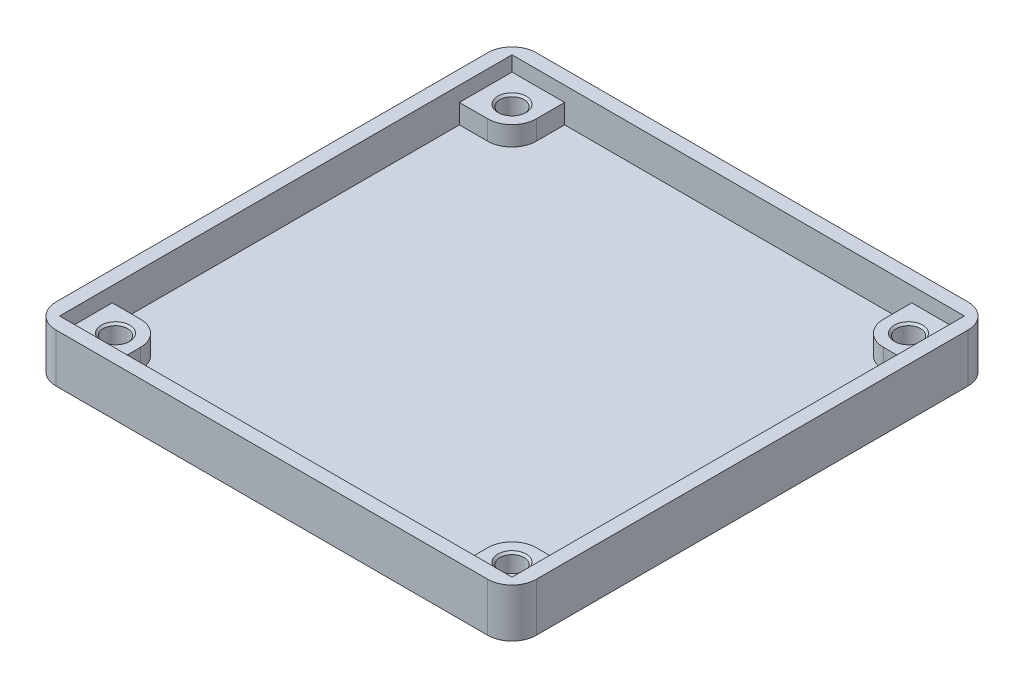
ISO-10303-21;
HEADER;
FILE_DESCRIPTION(('STEP AP214'),'2;1');
FILE_NAME('part.step','',(''),(''),'','','');
FILE_SCHEMA(('AUTOMOTIVE_DESIGN { 1 0 10303 214 1 1 1 1 }'));
ENDSEC;
DATA;
#1=APPLICATION_CONTEXT('core data for automotive mechanical design processes');
#2=APPLICATION_PROTOCOL_DEFINITION('international standard','automotive_design',2000,#1);
#3=PRODUCT_CONTEXT('',#1,'mechanical');
#4=PRODUCT('Part','Part','',(#3));
#5=PRODUCT_RELATED_PRODUCT_CATEGORY('part','',(#4));
#6=PRODUCT_DEFINITION_FORMATION('','',#4);
#7=PRODUCT_DEFINITION_CONTEXT('part definition',#1,'design');
#8=PRODUCT_DEFINITION('design','',#6,#7);
#9=PRODUCT_DEFINITION_SHAPE('','',#8);
#10=(LENGTH_UNIT() NAMED_UNIT(*) SI_UNIT(.MILLI.,.METRE.));
#11=(NAMED_UNIT(*) PLANE_ANGLE_UNIT() SI_UNIT($,.RADIAN.));
#12=(NAMED_UNIT(*) SI_UNIT($,.STERADIAN.) SOLID_ANGLE_UNIT());
#13=UNCERTAINTY_MEASURE_WITH_UNIT(LENGTH_MEASURE(1.E-05),#10,'distance_accuracy_value','');
#14=(GEOMETRIC_REPRESENTATION_CONTEXT(3) GLOBAL_UNCERTAINTY_ASSIGNED_CONTEXT((#13)) GLOBAL_UNIT_ASSIGNED_CONTEXT((#10,
#11,#12)) REPRESENTATION_CONTEXT('',''));
#15=CARTESIAN_POINT('',(0.,0.,0.));
#16=DIRECTION('',(0.,0.,1.));
#17=DIRECTION('',(1.,0.,0.));
#18=AXIS2_PLACEMENT_3D('',#15,#16,#17);
#19=CARTESIAN_POINT('',(0.,4.15,0.));
#20=DIRECTION('',(0.,1.,0.));
#21=DIRECTION('',(0.,0.,1.));
#22=AXIS2_PLACEMENT_3D('',#19,#20,#21);
#23=PLANE('',#22);
#24=CARTESIAN_POINT('',(-24.5,4.15,-24.5));
#25=DIRECTION('',(0.,1.,0.));
#26=DIRECTION('',(0.,0.,1.));
#27=AXIS2_PLACEMENT_3D('',#24,#25,#26);
#28=CIRCLE('',#27,1.75000000000001);
#29=CARTESIAN_POINT('',(-24.5,4.15,-22.75));
#30=VERTEX_POINT('',#29);
#31=EDGE_CURVE('E47',#30,#30,#28,.F.);
#32=ORIENTED_EDGE('',*,*,#31,.T.);
#33=EDGE_LOOP('',(#32));
#34=FACE_BOUND('',#33,.T.);
#35=DIRECTION('',(-1.,0.,0.));
#36=VECTOR('',#35,1.);
#37=CARTESIAN_POINT('',(-27.95,4.15,-21.45));
#38=LINE('',#37,#36);
#39=CARTESIAN_POINT('',(-24.45,4.15,-21.45));
#40=VERTEX_POINT('',#39);
#41=CARTESIAN_POINT('',(-27.95,4.15,-21.45));
#42=VERTEX_POINT('',#41);
#43=EDGE_CURVE('E252',#40,#42,#38,.T.);
#44=ORIENTED_EDGE('',*,*,#43,.F.);
#45=CARTESIAN_POINT('',(-24.45,4.15,-24.45));
#46=DIRECTION('',(0.,1.,0.));
#47=DIRECTION('',(0.,0.,1.));
#48=AXIS2_PLACEMENT_3D('',#45,#46,#47);
#49=CIRCLE('',#48,3.);
#50=CARTESIAN_POINT('',(-21.45,4.15,-24.45));
#51=VERTEX_POINT('',#50);
#52=EDGE_CURVE('E434',#40,#51,#49,.T.);
#53=ORIENTED_EDGE('',*,*,#52,.T.);
#54=DIRECTION('',(0.,0.,1.));
#55=VECTOR('',#54,1.);
#56=CARTESIAN_POINT('',(-21.45,4.15,-21.45));
#57=LINE('',#56,#55);
#58=CARTESIAN_POINT('',(-21.45,4.15,-27.95));
#59=VERTEX_POINT('',#58);
#60=EDGE_CURVE('E254',#59,#51,#57,.T.);
#61=ORIENTED_EDGE('',*,*,#60,.F.);
#62=DIRECTION('',(-1.,0.,0.));
#63=VECTOR('',#62,1.);
#64=CARTESIAN_POINT('',(27.95,4.15,-27.95));
#65=LINE('',#64,#63);
#66=CARTESIAN_POINT('',(-27.95,4.15,-27.95));
#67=VERTEX_POINT('',#66);
#68=EDGE_CURVE('E323',#59,#67,#65,.T.);
#69=ORIENTED_EDGE('',*,*,#68,.T.);
#70=DIRECTION('',(0.,0.,1.));
#71=VECTOR('',#70,1.);
#72=CARTESIAN_POINT('',(-27.95,4.15,27.95));
#73=LINE('',#72,#71);
#74=EDGE_CURVE('E312',#67,#42,#73,.T.);
#75=ORIENTED_EDGE('',*,*,#74,.T.);
#76=EDGE_LOOP('',(#44,#53,#61,#69,#75));
#77=FACE_BOUND('',#76,.T.);
#78=ADVANCED_FACE('F38',(#34,#77),#23,.T.);
#79=CARTESIAN_POINT('',(24.5,4.15,-24.5));
#80=DIRECTION('',(0.,1.,0.));
#81=DIRECTION('',(0.,0.,1.));
#82=AXIS2_PLACEMENT_3D('',#79,#80,#81);
#83=CIRCLE('',#82,1.75000000000001);
#84=CARTESIAN_POINT('',(24.5,4.15,-22.75));
#85=VERTEX_POINT('',#84);
#86=EDGE_CURVE('E463',#85,#85,#83,.F.);
#87=ORIENTED_EDGE('',*,*,#86,.T.);
#88=EDGE_LOOP('',(#87));
#89=FACE_BOUND('',#88,.T.);
#90=DIRECTION('',(0.,0.,-1.));
#91=VECTOR('',#90,1.);
#92=CARTESIAN_POINT('',(21.45,4.15,-27.95));
#93=LINE('',#92,#91);
#94=CARTESIAN_POINT('',(21.45,4.15,-24.45));
#95=VERTEX_POINT('',#94);
#96=CARTESIAN_POINT('',(21.45,4.15,-27.95));
#97=VERTEX_POINT('',#96);
#98=EDGE_CURVE('E291',#95,#97,#93,.T.);
#99=ORIENTED_EDGE('',*,*,#98,.F.);
#100=CARTESIAN_POINT('',(24.45,4.15,-24.45));
#101=DIRECTION('',(0.,1.,0.));
#102=DIRECTION('',(0.,0.,1.));
#103=AXIS2_PLACEMENT_3D('',#100,#101,#102);
#104=CIRCLE('',#103,3.);
#105=CARTESIAN_POINT('',(24.45,4.15,-21.45));
#106=VERTEX_POINT('',#105);
#107=EDGE_CURVE('E62',#95,#106,#104,.T.);
#108=ORIENTED_EDGE('',*,*,#107,.T.);
#109=DIRECTION('',(-1.,0.,0.));
#110=VECTOR('',#109,1.);
#111=CARTESIAN_POINT('',(21.45,4.15,-21.45));
#112=LINE('',#111,#110);
#113=CARTESIAN_POINT('',(27.95,4.15,-21.45));
#114=VERTEX_POINT('',#113);
#115=EDGE_CURVE('E289',#114,#106,#112,.T.);
#116=ORIENTED_EDGE('',*,*,#115,.F.);
#117=DIRECTION('',(0.,0.,-1.));
#118=VECTOR('',#117,1.);
#119=CARTESIAN_POINT('',(27.95,4.15,27.95));
#120=LINE('',#119,#118);
#121=CARTESIAN_POINT('',(27.95,4.15,-27.95));
#122=VERTEX_POINT('',#121);
#123=EDGE_CURVE('E319',#114,#122,#120,.T.);
#124=ORIENTED_EDGE('',*,*,#123,.T.);
#125=EDGE_CURVE('E324',#122,#97,#65,.T.);
#126=ORIENTED_EDGE('',*,*,#125,.T.);
#127=EDGE_LOOP('',(#99,#108,#116,#124,#126));
#128=FACE_BOUND('',#127,.T.);
#129=ADVANCED_FACE('F483',(#89,#128),#23,.T.);
#130=CARTESIAN_POINT('',(24.5,4.15,24.5));
#131=DIRECTION('',(0.,1.,0.));
#132=DIRECTION('',(0.,0.,1.));
#133=AXIS2_PLACEMENT_3D('',#130,#131,#132);
#134=CIRCLE('',#133,1.75000000000001);
#135=CARTESIAN_POINT('',(24.5,4.15,26.25));
#136=VERTEX_POINT('',#135);
#137=EDGE_CURVE('E451',#136,#136,#134,.F.);
#138=ORIENTED_EDGE('',*,*,#137,.T.);
#139=EDGE_LOOP('',(#138));
#140=FACE_BOUND('',#139,.T.);
#141=DIRECTION('',(1.,0.,0.));
#142=VECTOR('',#141,1.);
#143=CARTESIAN_POINT('',(27.95,4.15,21.45));
#144=LINE('',#143,#142);
#145=CARTESIAN_POINT('',(24.45,4.15,21.45));
#146=VERTEX_POINT('',#145);
#147=CARTESIAN_POINT('',(27.95,4.15,21.45));
#148=VERTEX_POINT('',#147);
#149=EDGE_CURVE('E287',#146,#148,#144,.T.);
#150=ORIENTED_EDGE('',*,*,#149,.F.);
#151=CARTESIAN_POINT('',(24.45,4.15,24.45));
#152=DIRECTION('',(0.,1.,0.));
#153=DIRECTION('',(0.,0.,1.));
#154=AXIS2_PLACEMENT_3D('',#151,#152,#153);
#155=CIRCLE('',#154,3.);
#156=CARTESIAN_POINT('',(21.45,4.15,24.45));
#157=VERTEX_POINT('',#156);
#158=EDGE_CURVE('E421',#146,#157,#155,.T.);
#159=ORIENTED_EDGE('',*,*,#158,.T.);
#160=DIRECTION('',(0.,0.,-1.));
#161=VECTOR('',#160,1.);
#162=CARTESIAN_POINT('',(21.45,4.15,21.45));
#163=LINE('',#162,#161);
#164=CARTESIAN_POINT('',(21.45,4.15,27.95));
#165=VERTEX_POINT('',#164);
#166=EDGE_CURVE('E284',#165,#157,#163,.T.);
#167=ORIENTED_EDGE('',*,*,#166,.F.);
#168=DIRECTION('',(1.,0.,0.));
#169=VECTOR('',#168,1.);
#170=CARTESIAN_POINT('',(27.95,4.15,27.95));
#171=LINE('',#170,#169);
#172=CARTESIAN_POINT('',(27.95,4.15,27.95));
#173=VERTEX_POINT('',#172);
#174=EDGE_CURVE('E315',#165,#173,#171,.T.);
#175=ORIENTED_EDGE('',*,*,#174,.T.);
#176=EDGE_CURVE('E320',#173,#148,#120,.T.);
#177=ORIENTED_EDGE('',*,*,#176,.T.);
#178=EDGE_LOOP('',(#150,#159,#167,#175,#177));
#179=FACE_BOUND('',#178,.T.);
#180=ADVANCED_FACE('F489',(#140,#179),#23,.T.);
#181=CARTESIAN_POINT('',(-24.5,0.,-24.5));
#182=DIRECTION('',(0.,1.,0.));
#183=DIRECTION('',(0.,0.,1.));
#184=AXIS2_PLACEMENT_3D('',#181,#182,#183);
#185=CYLINDRICAL_SURFACE('',#184,1.5);
#186=CARTESIAN_POINT('',(-24.5,3.89999999999999,-24.5));
#187=DIRECTION('',(0.,1.,0.));
#188=DIRECTION('',(0.,0.,1.));
#189=AXIS2_PLACEMENT_3D('',#186,#187,#188);
#190=CIRCLE('',#189,1.5);
#191=CARTESIAN_POINT('',(-24.5,3.89999999999999,-23.));
#192=VERTEX_POINT('',#191);
#193=EDGE_CURVE('E11',#192,#192,#190,.T.);
#194=ORIENTED_EDGE('',*,*,#193,.T.);
#195=EDGE_LOOP('',(#194));
#196=FACE_BOUND('',#195,.T.);
#197=CARTESIAN_POINT('',(-24.5,0.,-24.5));
#198=DIRECTION('',(0.,1.,0.));
#199=DIRECTION('',(0.,0.,1.));
#200=AXIS2_PLACEMENT_3D('',#197,#198,#199);
#201=CIRCLE('',#200,1.5);
#202=CARTESIAN_POINT('',(-24.5,0.,-23.));
#203=VERTEX_POINT('',#202);
#204=EDGE_CURVE('E353',#203,#203,#201,.T.);
#205=ORIENTED_EDGE('',*,*,#204,.F.);
#206=EDGE_LOOP('',(#205));
#207=FACE_BOUND('',#206,.T.);
#208=ADVANCED_FACE('F507',(#196,#207),#185,.F.);
#209=CARTESIAN_POINT('',(24.5,0.,24.5));
#210=DIRECTION('',(0.,1.,0.));
#211=DIRECTION('',(0.,0.,1.));
#212=AXIS2_PLACEMENT_3D('',#209,#210,#211);
#213=CYLINDRICAL_SURFACE('',#212,1.5);
#214=CARTESIAN_POINT('',(24.5,3.89999999999999,24.5));
#215=DIRECTION('',(0.,1.,0.));
#216=DIRECTION('',(0.,0.,1.));
#217=AXIS2_PLACEMENT_3D('',#214,#215,#216);
#218=CIRCLE('',#217,1.5);
#219=CARTESIAN_POINT('',(24.5,3.89999999999999,26.));
#220=VERTEX_POINT('',#219);
#221=EDGE_CURVE('E454',#220,#220,#218,.T.);
#222=ORIENTED_EDGE('',*,*,#221,.T.);
#223=EDGE_LOOP('',(#222));
#224=FACE_BOUND('',#223,.T.);
#225=CARTESIAN_POINT('',(24.5,0.,24.5));
#226=DIRECTION('',(0.,1.,0.));
#227=DIRECTION('',(0.,0.,1.));
#228=AXIS2_PLACEMENT_3D('',#225,#226,#227);
#229=CIRCLE('',#228,1.5);
#230=CARTESIAN_POINT('',(24.5,0.,26.));
#231=VERTEX_POINT('',#230);
#232=EDGE_CURVE('E340',#231,#231,#229,.T.);
#233=ORIENTED_EDGE('',*,*,#232,.F.);
#234=EDGE_LOOP('',(#233));
#235=FACE_BOUND('',#234,.T.);
#236=ADVANCED_FACE('F512',(#224,#235),#213,.F.);
#237=CARTESIAN_POINT('',(-24.5,0.,24.5));
#238=DIRECTION('',(0.,1.,0.));
#239=DIRECTION('',(0.,0.,1.));
#240=AXIS2_PLACEMENT_3D('',#237,#238,#239);
#241=CYLINDRICAL_SURFACE('',#240,1.5);
#242=CARTESIAN_POINT('',(-24.5,3.89999999999999,24.5));
#243=DIRECTION('',(0.,1.,0.));
#244=DIRECTION('',(0.,0.,1.));
#245=AXIS2_PLACEMENT_3D('',#242,#243,#244);
#246=CIRCLE('',#245,1.5);
#247=CARTESIAN_POINT('',(-24.5,3.89999999999999,26.));
#248=VERTEX_POINT('',#247);
#249=EDGE_CURVE('E460',#248,#248,#246,.T.);
#250=ORIENTED_EDGE('',*,*,#249,.T.);
#251=EDGE_LOOP('',(#250));
#252=FACE_BOUND('',#251,.T.);
#253=CARTESIAN_POINT('',(-24.5,0.,24.5));
#254=DIRECTION('',(0.,1.,0.));
#255=DIRECTION('',(0.,0.,1.));
#256=AXIS2_PLACEMENT_3D('',#253,#254,#255);
#257=CIRCLE('',#256,1.5);
#258=CARTESIAN_POINT('',(-24.5,0.,26.));
#259=VERTEX_POINT('',#258);
#260=EDGE_CURVE('E349',#259,#259,#257,.T.);
#261=ORIENTED_EDGE('',*,*,#260,.F.);
#262=EDGE_LOOP('',(#261));
#263=FACE_BOUND('',#262,.T.);
#264=ADVANCED_FACE('F659',(#252,#263),#241,.F.);
#265=CARTESIAN_POINT('',(24.5,0.,-24.5));
#266=DIRECTION('',(0.,1.,0.));
#267=DIRECTION('',(0.,0.,1.));
#268=AXIS2_PLACEMENT_3D('',#265,#266,#267);
#269=CYLINDRICAL_SURFACE('',#268,1.5);
#270=CARTESIAN_POINT('',(24.5,3.89999999999999,-24.5));
#271=DIRECTION('',(0.,1.,0.));
#272=DIRECTION('',(0.,0.,1.));
#273=AXIS2_PLACEMENT_3D('',#270,#271,#272);
#274=CIRCLE('',#273,1.5);
#275=CARTESIAN_POINT('',(24.5,3.89999999999999,-23.));
#276=VERTEX_POINT('',#275);
#277=EDGE_CURVE('E466',#276,#276,#274,.T.);
#278=ORIENTED_EDGE('',*,*,#277,.T.);
#279=EDGE_LOOP('',(#278));
#280=FACE_BOUND('',#279,.T.);
#281=CARTESIAN_POINT('',(24.5,0.,-24.5));
#282=DIRECTION('',(0.,1.,0.));
#283=DIRECTION('',(0.,0.,1.));
#284=AXIS2_PLACEMENT_3D('',#281,#282,#283);
#285=CIRCLE('',#284,1.5);
#286=CARTESIAN_POINT('',(24.5,0.,-23.));
#287=VERTEX_POINT('',#286);
#288=EDGE_CURVE('E350',#287,#287,#285,.T.);
#289=ORIENTED_EDGE('',*,*,#288,.F.);
#290=EDGE_LOOP('',(#289));
#291=FACE_BOUND('',#290,.T.);
#292=ADVANCED_FACE('F662',(#280,#291),#269,.F.);
#293=CARTESIAN_POINT('',(-29.675,6.,29.675));
#294=DIRECTION('',(0.,0.,-1.));
#295=DIRECTION('',(-1.,0.,0.));
#296=AXIS2_PLACEMENT_3D('',#293,#294,#295);
#297=PLANE('',#296);
#298=DIRECTION('',(1.,0.,0.));
#299=VECTOR('',#298,1.);
#300=CARTESIAN_POINT('',(-29.675,6.,29.675));
#301=LINE('',#300,#299);
#302=CARTESIAN_POINT('',(-26.675,6.,29.675));
#303=VERTEX_POINT('',#302);
#304=CARTESIAN_POINT('',(26.675,6.,29.675));
#305=VERTEX_POINT('',#304);
#306=EDGE_CURVE('E359',#303,#305,#301,.T.);
#307=ORIENTED_EDGE('',*,*,#306,.F.);
#308=DIRECTION('',(0.,-1.,0.));
#309=VECTOR('',#308,1.);
#310=CARTESIAN_POINT('',(-26.675,0.,29.675));
#311=LINE('',#310,#309);
#312=CARTESIAN_POINT('',(-26.675,0.,29.675));
#313=VERTEX_POINT('',#312);
#314=EDGE_CURVE('E384',#303,#313,#311,.T.);
#315=ORIENTED_EDGE('',*,*,#314,.T.);
#316=DIRECTION('',(1.,0.,0.));
#317=VECTOR('',#316,1.);
#318=CARTESIAN_POINT('',(-29.675,0.,29.675));
#319=LINE('',#318,#317);
#320=CARTESIAN_POINT('',(26.675,0.,29.675));
#321=VERTEX_POINT('',#320);
#322=EDGE_CURVE('E358',#313,#321,#319,.T.);
#323=ORIENTED_EDGE('',*,*,#322,.T.);
#324=DIRECTION('',(0.,-1.,0.));
#325=VECTOR('',#324,1.);
#326=CARTESIAN_POINT('',(26.675,6.,29.675));
#327=LINE('',#326,#325);
#328=EDGE_CURVE('E372',#321,#305,#327,.F.);
#329=ORIENTED_EDGE('',*,*,#328,.T.);
#330=EDGE_LOOP('',(#307,#315,#323,#329));
#331=FACE_BOUND('',#330,.T.);
#332=ADVANCED_FACE('F618',(#331),#297,.F.);
#333=CARTESIAN_POINT('',(29.675,6.,29.675));
#334=DIRECTION('',(-1.,0.,0.));
#335=DIRECTION('',(0.,0.,1.));
#336=AXIS2_PLACEMENT_3D('',#333,#334,#335);
#337=PLANE('',#336);
#338=DIRECTION('',(0.,0.,-1.));
#339=VECTOR('',#338,1.);
#340=CARTESIAN_POINT('',(29.675,6.,29.675));
#341=LINE('',#340,#339);
#342=CARTESIAN_POINT('',(29.675,6.,26.675));
#343=VERTEX_POINT('',#342);
#344=CARTESIAN_POINT('',(29.675,6.,-26.675));
#345=VERTEX_POINT('',#344);
#346=EDGE_CURVE('E362',#343,#345,#341,.T.);
#347=ORIENTED_EDGE('',*,*,#346,.F.);
#348=DIRECTION('',(0.,-1.,0.));
#349=VECTOR('',#348,1.);
#350=CARTESIAN_POINT('',(29.675,6.,26.675));
#351=LINE('',#350,#349);
#352=CARTESIAN_POINT('',(29.675,0.,26.675));
#353=VERTEX_POINT('',#352);
#354=EDGE_CURVE('E410',#343,#353,#351,.T.);
#355=ORIENTED_EDGE('',*,*,#354,.T.);
#356=DIRECTION('',(0.,0.,-1.));
#357=VECTOR('',#356,1.);
#358=CARTESIAN_POINT('',(29.675,0.,29.675));
#359=LINE('',#358,#357);
#360=CARTESIAN_POINT('',(29.675,0.,-26.675));
#361=VERTEX_POINT('',#360);
#362=EDGE_CURVE('E375',#353,#361,#359,.T.);
#363=ORIENTED_EDGE('',*,*,#362,.T.);
#364=DIRECTION('',(0.,-1.,0.));
#365=VECTOR('',#364,1.);
#366=CARTESIAN_POINT('',(29.675,6.,-26.675));
#367=LINE('',#366,#365);
#368=EDGE_CURVE('E408',#361,#345,#367,.F.);
#369=ORIENTED_EDGE('',*,*,#368,.T.);
#370=EDGE_LOOP('',(#347,#355,#363,#369));
#371=FACE_BOUND('',#370,.T.);
#372=ADVANCED_FACE('F684',(#371),#337,.F.);
#373=CARTESIAN_POINT('',(-29.675,6.,-29.675));
#374=DIRECTION('',(0.,0.,-1.));
#375=DIRECTION('',(-1.,0.,0.));
#376=AXIS2_PLACEMENT_3D('',#373,#374,#375);
#377=PLANE('',#376);
#378=DIRECTION('',(1.,0.,0.));
#379=VECTOR('',#378,1.);
#380=CARTESIAN_POINT('',(-29.675,6.,-29.675));
#381=LINE('',#380,#379);
#382=CARTESIAN_POINT('',(-26.675,6.,-29.675));
#383=VERTEX_POINT('',#382);
#384=CARTESIAN_POINT('',(26.675,6.,-29.675));
#385=VERTEX_POINT('',#384);
#386=EDGE_CURVE('E366',#383,#385,#381,.T.);
#387=ORIENTED_EDGE('',*,*,#386,.T.);
#388=DIRECTION('',(0.,-1.,0.));
#389=VECTOR('',#388,1.);
#390=CARTESIAN_POINT('',(26.675,0.,-29.675));
#391=LINE('',#390,#389);
#392=CARTESIAN_POINT('',(26.675,0.,-29.675));
#393=VERTEX_POINT('',#392);
#394=EDGE_CURVE('E415',#385,#393,#391,.T.);
#395=ORIENTED_EDGE('',*,*,#394,.T.);
#396=DIRECTION('',(1.,0.,0.));
#397=VECTOR('',#396,1.);
#398=CARTESIAN_POINT('',(-29.675,0.,-29.675));
#399=LINE('',#398,#397);
#400=CARTESIAN_POINT('',(-26.675,0.,-29.675));
#401=VERTEX_POINT('',#400);
#402=EDGE_CURVE('E378',#401,#393,#399,.T.);
#403=ORIENTED_EDGE('',*,*,#402,.F.);
#404=DIRECTION('',(0.,-1.,0.));
#405=VECTOR('',#404,1.);
#406=CARTESIAN_POINT('',(-26.675,6.,-29.675));
#407=LINE('',#406,#405);
#408=EDGE_CURVE('E413',#401,#383,#407,.F.);
#409=ORIENTED_EDGE('',*,*,#408,.T.);
#410=EDGE_LOOP('',(#387,#395,#403,#409));
#411=FACE_BOUND('',#410,.T.);
#412=ADVANCED_FACE('F690',(#411),#377,.T.);
#413=CARTESIAN_POINT('',(-29.675,6.,29.675));
#414=DIRECTION('',(-1.,0.,0.));
#415=DIRECTION('',(0.,0.,1.));
#416=AXIS2_PLACEMENT_3D('',#413,#414,#415);
#417=PLANE('',#416);
#418=DIRECTION('',(0.,0.,-1.));
#419=VECTOR('',#418,1.);
#420=CARTESIAN_POINT('',(-29.675,0.,29.675));
#421=LINE('',#420,#419);
#422=CARTESIAN_POINT('',(-29.675,0.,26.675));
#423=VERTEX_POINT('',#422);
#424=CARTESIAN_POINT('',(-29.675,0.,-26.675));
#425=VERTEX_POINT('',#424);
#426=EDGE_CURVE('E363',#423,#425,#421,.T.);
#427=ORIENTED_EDGE('',*,*,#426,.F.);
#428=DIRECTION('',(0.,-1.,0.));
#429=VECTOR('',#428,1.);
#430=CARTESIAN_POINT('',(-29.675,6.,26.675));
#431=LINE('',#430,#429);
#432=CARTESIAN_POINT('',(-29.675,6.,26.675));
#433=VERTEX_POINT('',#432);
#434=EDGE_CURVE('E398',#423,#433,#431,.F.);
#435=ORIENTED_EDGE('',*,*,#434,.T.);
#436=DIRECTION('',(0.,0.,-1.));
#437=VECTOR('',#436,1.);
#438=CARTESIAN_POINT('',(-29.675,6.,29.675));
#439=LINE('',#438,#437);
#440=CARTESIAN_POINT('',(-29.675,6.,-26.675));
#441=VERTEX_POINT('',#440);
#442=EDGE_CURVE('E369',#433,#441,#439,.T.);
#443=ORIENTED_EDGE('',*,*,#442,.T.);
#444=DIRECTION('',(0.,-1.,0.));
#445=VECTOR('',#444,1.);
#446=CARTESIAN_POINT('',(-29.675,6.,-26.675));
#447=LINE('',#446,#445);
#448=EDGE_CURVE('E395',#441,#425,#447,.T.);
#449=ORIENTED_EDGE('',*,*,#448,.T.);
#450=EDGE_LOOP('',(#427,#435,#443,#449));
#451=FACE_BOUND('',#450,.T.);
#452=ADVANCED_FACE('F695',(#451),#417,.T.);
#453=CARTESIAN_POINT('',(0.,6.,0.));
#454=DIRECTION('',(0.,1.,0.));
#455=DIRECTION('',(0.,0.,1.));
#456=AXIS2_PLACEMENT_3D('',#453,#454,#455);
#457=PLANE('',#456);
#458=DIRECTION('',(0.,0.,1.));
#459=VECTOR('',#458,1.);
#460=CARTESIAN_POINT('',(-27.95,6.,27.95));
#461=LINE('',#460,#459);
#462=CARTESIAN_POINT('',(-27.95,6.,-27.95));
#463=VERTEX_POINT('',#462);
#464=CARTESIAN_POINT('',(-27.95,6.,27.95));
#465=VERTEX_POINT('',#464);
#466=EDGE_CURVE('E297',#463,#465,#461,.T.);
#467=ORIENTED_EDGE('',*,*,#466,.F.);
#468=DIRECTION('',(-1.,0.,0.));
#469=VECTOR('',#468,1.);
#470=CARTESIAN_POINT('',(27.95,6.,-27.95));
#471=LINE('',#470,#469);
#472=CARTESIAN_POINT('',(27.95,6.,-27.95));
#473=VERTEX_POINT('',#472);
#474=EDGE_CURVE('E335',#473,#463,#471,.T.);
#475=ORIENTED_EDGE('',*,*,#474,.F.);
#476=DIRECTION('',(0.,0.,-1.));
#477=VECTOR('',#476,1.);
#478=CARTESIAN_POINT('',(27.95,6.,27.95));
#479=LINE('',#478,#477);
#480=CARTESIAN_POINT('',(27.95,6.,27.95));
#481=VERTEX_POINT('',#480);
#482=EDGE_CURVE('E332',#481,#473,#479,.T.);
#483=ORIENTED_EDGE('',*,*,#482,.F.);
#484=DIRECTION('',(1.,0.,0.));
#485=VECTOR('',#484,1.);
#486=CARTESIAN_POINT('',(27.95,6.,27.95));
#487=LINE('',#486,#485);
#488=EDGE_CURVE('E329',#465,#481,#487,.T.);
#489=ORIENTED_EDGE('',*,*,#488,.F.);
#490=EDGE_LOOP('',(#467,#475,#483,#489));
#491=FACE_BOUND('',#490,.T.);
#492=ORIENTED_EDGE('',*,*,#442,.F.);
#493=CARTESIAN_POINT('',(-26.675,6.,26.675));
#494=DIRECTION('',(0.,1.,0.));
#495=DIRECTION('',(0.,0.,1.));
#496=AXIS2_PLACEMENT_3D('',#493,#494,#495);
#497=CIRCLE('',#496,3.);
#498=EDGE_CURVE('E406',#433,#303,#497,.T.);
#499=ORIENTED_EDGE('',*,*,#498,.T.);
#500=ORIENTED_EDGE('',*,*,#306,.T.);
#501=CARTESIAN_POINT('',(26.675,6.,26.675));
#502=DIRECTION('',(0.,1.,0.));
#503=DIRECTION('',(0.,0.,1.));
#504=AXIS2_PLACEMENT_3D('',#501,#502,#503);
#505=CIRCLE('',#504,3.);
#506=EDGE_CURVE('E404',#305,#343,#505,.T.);
#507=ORIENTED_EDGE('',*,*,#506,.T.);
#508=ORIENTED_EDGE('',*,*,#346,.T.);
#509=CARTESIAN_POINT('',(26.675,6.,-26.675));
#510=DIRECTION('',(0.,1.,0.));
#511=DIRECTION('',(0.,0.,1.));
#512=AXIS2_PLACEMENT_3D('',#509,#510,#511);
#513=CIRCLE('',#512,3.);
#514=EDGE_CURVE('E402',#345,#385,#513,.T.);
#515=ORIENTED_EDGE('',*,*,#514,.T.);
#516=ORIENTED_EDGE('',*,*,#386,.F.);
#517=CARTESIAN_POINT('',(-26.675,6.,-26.675));
#518=DIRECTION('',(0.,1.,0.));
#519=DIRECTION('',(0.,0.,1.));
#520=AXIS2_PLACEMENT_3D('',#517,#518,#519);
#521=CIRCLE('',#520,3.);
#522=EDGE_CURVE('E400',#383,#441,#521,.T.);
#523=ORIENTED_EDGE('',*,*,#522,.T.);
#524=EDGE_LOOP('',(#492,#499,#500,#507,#508,#515,#516,#523));
#525=FACE_BOUND('',#524,.T.);
#526=ADVANCED_FACE('F502',(#491,#525),#457,.T.);
#527=CARTESIAN_POINT('',(0.,0.,0.));
#528=DIRECTION('',(0.,1.,0.));
#529=DIRECTION('',(0.,0.,1.));
#530=AXIS2_PLACEMENT_3D('',#527,#528,#529);
#531=PLANE('',#530);
#532=ORIENTED_EDGE('',*,*,#288,.T.);
#533=EDGE_LOOP('',(#532));
#534=FACE_BOUND('',#533,.T.);
#535=ORIENTED_EDGE('',*,*,#260,.T.);
#536=EDGE_LOOP('',(#535));
#537=FACE_BOUND('',#536,.T.);
#538=ORIENTED_EDGE('',*,*,#232,.T.);
#539=EDGE_LOOP('',(#538));
#540=FACE_BOUND('',#539,.T.);
#541=ORIENTED_EDGE('',*,*,#204,.T.);
#542=EDGE_LOOP('',(#541));
#543=FACE_BOUND('',#542,.T.);
#544=ORIENTED_EDGE('',*,*,#322,.F.);
#545=CARTESIAN_POINT('',(-26.675,0.,26.675));
#546=DIRECTION('',(0.,1.,0.));
#547=DIRECTION('',(0.,0.,1.));
#548=AXIS2_PLACEMENT_3D('',#545,#546,#547);
#549=CIRCLE('',#548,3.);
#550=EDGE_CURVE('E393',#313,#423,#549,.F.);
#551=ORIENTED_EDGE('',*,*,#550,.T.);
#552=ORIENTED_EDGE('',*,*,#426,.T.);
#553=CARTESIAN_POINT('',(-26.675,0.,-26.675));
#554=DIRECTION('',(0.,1.,0.));
#555=DIRECTION('',(0.,0.,1.));
#556=AXIS2_PLACEMENT_3D('',#553,#554,#555);
#557=CIRCLE('',#556,3.);
#558=EDGE_CURVE('E387',#425,#401,#557,.F.);
#559=ORIENTED_EDGE('',*,*,#558,.T.);
#560=ORIENTED_EDGE('',*,*,#402,.T.);
#561=CARTESIAN_POINT('',(26.675,0.,-26.675));
#562=DIRECTION('',(0.,1.,0.));
#563=DIRECTION('',(0.,0.,1.));
#564=AXIS2_PLACEMENT_3D('',#561,#562,#563);
#565=CIRCLE('',#564,3.);
#566=EDGE_CURVE('E389',#393,#361,#565,.F.);
#567=ORIENTED_EDGE('',*,*,#566,.T.);
#568=ORIENTED_EDGE('',*,*,#362,.F.);
#569=CARTESIAN_POINT('',(26.675,0.,26.675));
#570=DIRECTION('',(0.,1.,0.));
#571=DIRECTION('',(0.,0.,1.));
#572=AXIS2_PLACEMENT_3D('',#569,#570,#571);
#573=CIRCLE('',#572,3.);
#574=EDGE_CURVE('E391',#353,#321,#573,.F.);
#575=ORIENTED_EDGE('',*,*,#574,.T.);
#576=EDGE_LOOP('',(#544,#551,#552,#559,#560,#567,#568,#575));
#577=FACE_BOUND('',#576,.T.);
#578=ADVANCED_FACE('F494',(#534,#537,#540,#543,#577),#531,.F.);
#579=CARTESIAN_POINT('',(-24.5,4.15,24.5));
#580=DIRECTION('',(0.,1.,0.));
#581=DIRECTION('',(0.,0.,1.));
#582=AXIS2_PLACEMENT_3D('',#579,#580,#581);
#583=CIRCLE('',#582,1.75000000000001);
#584=CARTESIAN_POINT('',(-24.5,4.15,26.25));
#585=VERTEX_POINT('',#584);
#586=EDGE_CURVE('E457',#585,#585,#583,.F.);
#587=ORIENTED_EDGE('',*,*,#586,.T.);
#588=EDGE_LOOP('',(#587));
#589=FACE_BOUND('',#588,.T.);
#590=DIRECTION('',(0.,0.,1.));
#591=VECTOR('',#590,1.);
#592=CARTESIAN_POINT('',(-21.45,4.15,27.95));
#593=LINE('',#592,#591);
#594=CARTESIAN_POINT('',(-21.45,4.15,24.45));
#595=VERTEX_POINT('',#594);
#596=CARTESIAN_POINT('',(-21.45,4.15,27.95));
#597=VERTEX_POINT('',#596);
#598=EDGE_CURVE('E282',#595,#597,#593,.T.);
#599=ORIENTED_EDGE('',*,*,#598,.F.);
#600=CARTESIAN_POINT('',(-24.45,4.15,24.45));
#601=DIRECTION('',(0.,1.,0.));
#602=DIRECTION('',(0.,0.,1.));
#603=AXIS2_PLACEMENT_3D('',#600,#601,#602);
#604=CIRCLE('',#603,3.);
#605=CARTESIAN_POINT('',(-24.45,4.15,21.45));
#606=VERTEX_POINT('',#605);
#607=EDGE_CURVE('E428',#595,#606,#604,.T.);
#608=ORIENTED_EDGE('',*,*,#607,.T.);
#609=DIRECTION('',(1.,0.,0.));
#610=VECTOR('',#609,1.);
#611=CARTESIAN_POINT('',(-21.45,4.15,21.45));
#612=LINE('',#611,#610);
#613=CARTESIAN_POINT('',(-27.95,4.15,21.45));
#614=VERTEX_POINT('',#613);
#615=EDGE_CURVE('E280',#614,#606,#612,.T.);
#616=ORIENTED_EDGE('',*,*,#615,.F.);
#617=CARTESIAN_POINT('',(-27.95,4.15,27.95));
#618=VERTEX_POINT('',#617);
#619=EDGE_CURVE('E233',#614,#618,#73,.T.);
#620=ORIENTED_EDGE('',*,*,#619,.T.);
#621=EDGE_CURVE('E316',#618,#597,#171,.T.);
#622=ORIENTED_EDGE('',*,*,#621,.T.);
#623=EDGE_LOOP('',(#599,#608,#616,#620,#622));
#624=FACE_BOUND('',#623,.T.);
#625=ADVANCED_FACE('F485',(#589,#624),#23,.T.);
#626=CARTESIAN_POINT('',(-27.95,4.15,27.95));
#627=DIRECTION('',(-1.,0.,0.));
#628=DIRECTION('',(0.,0.,1.));
#629=AXIS2_PLACEMENT_3D('',#626,#627,#628);
#630=PLANE('',#629);
#631=ORIENTED_EDGE('',*,*,#466,.T.);
#632=DIRECTION('',(0.,1.,0.));
#633=VECTOR('',#632,1.);
#634=CARTESIAN_POINT('',(-27.95,4.15,27.95));
#635=LINE('',#634,#633);
#636=EDGE_CURVE('E327',#618,#465,#635,.T.);
#637=ORIENTED_EDGE('',*,*,#636,.F.);
#638=ORIENTED_EDGE('',*,*,#619,.F.);
#639=DIRECTION('',(0.,1.,0.));
#640=VECTOR('',#639,1.);
#641=CARTESIAN_POINT('',(-27.95,1.75,21.45));
#642=LINE('',#641,#640);
#643=CARTESIAN_POINT('',(-27.95,1.75,21.45));
#644=VERTEX_POINT('',#643);
#645=EDGE_CURVE('E226',#644,#614,#642,.T.);
#646=ORIENTED_EDGE('',*,*,#645,.F.);
#647=DIRECTION('',(0.,0.,1.));
#648=VECTOR('',#647,1.);
#649=CARTESIAN_POINT('',(-27.95,1.75,21.45));
#650=LINE('',#649,#648);
#651=CARTESIAN_POINT('',(-27.95,1.75,-21.45));
#652=VERTEX_POINT('',#651);
#653=EDGE_CURVE('E231',#652,#644,#650,.T.);
#654=ORIENTED_EDGE('',*,*,#653,.F.);
#655=DIRECTION('',(0.,1.,0.));
#656=VECTOR('',#655,1.);
#657=CARTESIAN_POINT('',(-27.95,1.75,-21.45));
#658=LINE('',#657,#656);
#659=EDGE_CURVE('E295',#652,#42,#658,.T.);
#660=ORIENTED_EDGE('',*,*,#659,.T.);
#661=ORIENTED_EDGE('',*,*,#74,.F.);
#662=DIRECTION('',(0.,1.,0.));
#663=VECTOR('',#662,1.);
#664=CARTESIAN_POINT('',(-27.95,4.15,-27.95));
#665=LINE('',#664,#663);
#666=EDGE_CURVE('E338',#67,#463,#665,.T.);
#667=ORIENTED_EDGE('',*,*,#666,.T.);
#668=EDGE_LOOP('',(#631,#637,#638,#646,#654,#660,#661,#667));
#669=FACE_BOUND('',#668,.T.);
#670=ADVANCED_FACE('F228',(#669),#630,.F.);
#671=CARTESIAN_POINT('',(27.95,4.15,-27.95));
#672=DIRECTION('',(0.,0.,-1.));
#673=DIRECTION('',(-1.,0.,0.));
#674=AXIS2_PLACEMENT_3D('',#671,#672,#673);
#675=PLANE('',#674);
#676=ORIENTED_EDGE('',*,*,#474,.T.);
#677=ORIENTED_EDGE('',*,*,#666,.F.);
#678=ORIENTED_EDGE('',*,*,#68,.F.);
#679=DIRECTION('',(0.,1.,0.));
#680=VECTOR('',#679,1.);
#681=CARTESIAN_POINT('',(-21.45,1.75,-27.95));
#682=LINE('',#681,#680);
#683=CARTESIAN_POINT('',(-21.45,1.75,-27.95));
#684=VERTEX_POINT('',#683);
#685=EDGE_CURVE('E298',#684,#59,#682,.T.);
#686=ORIENTED_EDGE('',*,*,#685,.F.);
#687=DIRECTION('',(-1.,0.,0.));
#688=VECTOR('',#687,1.);
#689=CARTESIAN_POINT('',(-21.45,1.75,-27.95));
#690=LINE('',#689,#688);
#691=CARTESIAN_POINT('',(21.45,1.75,-27.95));
#692=VERTEX_POINT('',#691);
#693=EDGE_CURVE('E273',#692,#684,#690,.T.);
#694=ORIENTED_EDGE('',*,*,#693,.F.);
#695=DIRECTION('',(0.,1.,0.));
#696=VECTOR('',#695,1.);
#697=CARTESIAN_POINT('',(21.45,1.75,-27.95));
#698=LINE('',#697,#696);
#699=EDGE_CURVE('E300',#692,#97,#698,.T.);
#700=ORIENTED_EDGE('',*,*,#699,.T.);
#701=ORIENTED_EDGE('',*,*,#125,.F.);
#702=DIRECTION('',(0.,1.,0.));
#703=VECTOR('',#702,1.);
#704=CARTESIAN_POINT('',(27.95,4.15,-27.95));
#705=LINE('',#704,#703);
#706=EDGE_CURVE('E341',#122,#473,#705,.T.);
#707=ORIENTED_EDGE('',*,*,#706,.T.);
#708=EDGE_LOOP('',(#676,#677,#678,#686,#694,#700,#701,#707));
#709=FACE_BOUND('',#708,.T.);
#710=ADVANCED_FACE('F500',(#709),#675,.F.);
#711=CARTESIAN_POINT('',(27.95,4.15,27.95));
#712=DIRECTION('',(1.,0.,0.));
#713=DIRECTION('',(0.,0.,-1.));
#714=AXIS2_PLACEMENT_3D('',#711,#712,#713);
#715=PLANE('',#714);
#716=ORIENTED_EDGE('',*,*,#482,.T.);
#717=ORIENTED_EDGE('',*,*,#706,.F.);
#718=ORIENTED_EDGE('',*,*,#123,.F.);
#719=DIRECTION('',(0.,1.,0.));
#720=VECTOR('',#719,1.);
#721=CARTESIAN_POINT('',(27.95,1.75,-21.45));
#722=LINE('',#721,#720);
#723=CARTESIAN_POINT('',(27.95,1.75,-21.45));
#724=VERTEX_POINT('',#723);
#725=EDGE_CURVE('E303',#724,#114,#722,.T.);
#726=ORIENTED_EDGE('',*,*,#725,.F.);
#727=DIRECTION('',(0.,0.,-1.));
#728=VECTOR('',#727,1.);
#729=CARTESIAN_POINT('',(27.95,1.75,-21.45));
#730=LINE('',#729,#728);
#731=CARTESIAN_POINT('',(27.95,1.75,21.45));
#732=VERTEX_POINT('',#731);
#733=EDGE_CURVE('E266',#732,#724,#730,.T.);
#734=ORIENTED_EDGE('',*,*,#733,.F.);
#735=DIRECTION('',(0.,1.,0.));
#736=VECTOR('',#735,1.);
#737=CARTESIAN_POINT('',(27.95,1.75,21.45));
#738=LINE('',#737,#736);
#739=EDGE_CURVE('E305',#732,#148,#738,.T.);
#740=ORIENTED_EDGE('',*,*,#739,.T.);
#741=ORIENTED_EDGE('',*,*,#176,.F.);
#742=DIRECTION('',(0.,1.,0.));
#743=VECTOR('',#742,1.);
#744=CARTESIAN_POINT('',(27.95,4.15,27.95));
#745=LINE('',#744,#743);
#746=EDGE_CURVE('E343',#173,#481,#745,.T.);
#747=ORIENTED_EDGE('',*,*,#746,.T.);
#748=EDGE_LOOP('',(#716,#717,#718,#726,#734,#740,#741,#747));
#749=FACE_BOUND('',#748,.T.);
#750=ADVANCED_FACE('F527',(#749),#715,.F.);
#751=CARTESIAN_POINT('',(27.95,4.15,27.95));
#752=DIRECTION('',(0.,0.,1.));
#753=DIRECTION('',(1.,0.,0.));
#754=AXIS2_PLACEMENT_3D('',#751,#752,#753);
#755=PLANE('',#754);
#756=ORIENTED_EDGE('',*,*,#488,.T.);
#757=ORIENTED_EDGE('',*,*,#746,.F.);
#758=ORIENTED_EDGE('',*,*,#174,.F.);
#759=DIRECTION('',(0.,1.,0.));
#760=VECTOR('',#759,1.);
#761=CARTESIAN_POINT('',(21.45,1.75,27.95));
#762=LINE('',#761,#760);
#763=CARTESIAN_POINT('',(21.45,1.75,27.95));
#764=VERTEX_POINT('',#763);
#765=EDGE_CURVE('E308',#764,#165,#762,.T.);
#766=ORIENTED_EDGE('',*,*,#765,.F.);
#767=DIRECTION('',(1.,0.,0.));
#768=VECTOR('',#767,1.);
#769=CARTESIAN_POINT('',(21.45,1.75,27.95));
#770=LINE('',#769,#768);
#771=CARTESIAN_POINT('',(-21.45,1.75,27.95));
#772=VERTEX_POINT('',#771);
#773=EDGE_CURVE('E258',#772,#764,#770,.T.);
#774=ORIENTED_EDGE('',*,*,#773,.F.);
#775=DIRECTION('',(0.,1.,0.));
#776=VECTOR('',#775,1.);
#777=CARTESIAN_POINT('',(-21.45,1.75,27.95));
#778=LINE('',#777,#776);
#779=EDGE_CURVE('E237',#772,#597,#778,.T.);
#780=ORIENTED_EDGE('',*,*,#779,.T.);
#781=ORIENTED_EDGE('',*,*,#621,.F.);
#782=ORIENTED_EDGE('',*,*,#636,.T.);
#783=EDGE_LOOP('',(#756,#757,#758,#766,#774,#780,#781,#782));
#784=FACE_BOUND('',#783,.T.);
#785=ADVANCED_FACE('F541',(#784),#755,.F.);
#786=CARTESIAN_POINT('',(-27.95,1.75,-21.45));
#787=DIRECTION('',(0.,0.,-1.));
#788=DIRECTION('',(-1.,0.,0.));
#789=AXIS2_PLACEMENT_3D('',#786,#787,#788);
#790=PLANE('',#789);
#791=DIRECTION('',(-1.,0.,0.));
#792=VECTOR('',#791,1.);
#793=CARTESIAN_POINT('',(-27.95,1.75,-21.45));
#794=LINE('',#793,#792);
#795=CARTESIAN_POINT('',(-24.45,1.75,-21.45));
#796=VERTEX_POINT('',#795);
#797=EDGE_CURVE('E238',#796,#652,#794,.T.);
#798=ORIENTED_EDGE('',*,*,#797,.F.);
#799=DIRECTION('',(0.,1.,0.));
#800=VECTOR('',#799,1.);
#801=CARTESIAN_POINT('',(-24.45,1.75,-21.45));
#802=LINE('',#801,#800);
#803=EDGE_CURVE('E431',#796,#40,#802,.T.);
#804=ORIENTED_EDGE('',*,*,#803,.T.);
#805=ORIENTED_EDGE('',*,*,#43,.T.);
#806=ORIENTED_EDGE('',*,*,#659,.F.);
#807=EDGE_LOOP('',(#798,#804,#805,#806));
#808=FACE_BOUND('',#807,.T.);
#809=ADVANCED_FACE('F575',(#808),#790,.F.);
#810=CARTESIAN_POINT('',(-21.45,1.75,-21.45));
#811=DIRECTION('',(-1.,0.,0.));
#812=DIRECTION('',(0.,0.,1.));
#813=AXIS2_PLACEMENT_3D('',#810,#811,#812);
#814=PLANE('',#813);
#815=ORIENTED_EDGE('',*,*,#60,.T.);
#816=DIRECTION('',(0.,1.,0.));
#817=VECTOR('',#816,1.);
#818=CARTESIAN_POINT('',(-21.45,1.75,-24.45));
#819=LINE('',#818,#817);
#820=CARTESIAN_POINT('',(-21.45,1.75,-24.45));
#821=VERTEX_POINT('',#820);
#822=EDGE_CURVE('E436',#51,#821,#819,.F.);
#823=ORIENTED_EDGE('',*,*,#822,.T.);
#824=DIRECTION('',(0.,0.,1.));
#825=VECTOR('',#824,1.);
#826=CARTESIAN_POINT('',(-21.45,1.75,-21.45));
#827=LINE('',#826,#825);
#828=EDGE_CURVE('E276',#684,#821,#827,.T.);
#829=ORIENTED_EDGE('',*,*,#828,.F.);
#830=ORIENTED_EDGE('',*,*,#685,.T.);
#831=EDGE_LOOP('',(#815,#823,#829,#830));
#832=FACE_BOUND('',#831,.T.);
#833=ADVANCED_FACE('F597',(#832),#814,.F.);
#834=CARTESIAN_POINT('',(21.45,1.75,-27.95));
#835=DIRECTION('',(1.,0.,0.));
#836=DIRECTION('',(0.,0.,-1.));
#837=AXIS2_PLACEMENT_3D('',#834,#835,#836);
#838=PLANE('',#837);
#839=DIRECTION('',(0.,0.,-1.));
#840=VECTOR('',#839,1.);
#841=CARTESIAN_POINT('',(21.45,1.75,-27.95));
#842=LINE('',#841,#840);
#843=CARTESIAN_POINT('',(21.45,1.75,-24.45));
#844=VERTEX_POINT('',#843);
#845=EDGE_CURVE('E271',#844,#692,#842,.T.);
#846=ORIENTED_EDGE('',*,*,#845,.F.);
#847=DIRECTION('',(0.,1.,0.));
#848=VECTOR('',#847,1.);
#849=CARTESIAN_POINT('',(21.45,1.75,-24.45));
#850=LINE('',#849,#848);
#851=EDGE_CURVE('E438',#844,#95,#850,.T.);
#852=ORIENTED_EDGE('',*,*,#851,.T.);
#853=ORIENTED_EDGE('',*,*,#98,.T.);
#854=ORIENTED_EDGE('',*,*,#699,.F.);
#855=EDGE_LOOP('',(#846,#852,#853,#854));
#856=FACE_BOUND('',#855,.T.);
#857=ADVANCED_FACE('F565',(#856),#838,.F.);
#858=CARTESIAN_POINT('',(21.45,1.75,-21.45));
#859=DIRECTION('',(0.,0.,-1.));
#860=DIRECTION('',(-1.,0.,0.));
#861=AXIS2_PLACEMENT_3D('',#858,#859,#860);
#862=PLANE('',#861);
#863=ORIENTED_EDGE('',*,*,#115,.T.);
#864=DIRECTION('',(0.,1.,0.));
#865=VECTOR('',#864,1.);
#866=CARTESIAN_POINT('',(24.45,1.75,-21.45));
#867=LINE('',#866,#865);
#868=CARTESIAN_POINT('',(24.45,1.75,-21.45));
#869=VERTEX_POINT('',#868);
#870=EDGE_CURVE('E54',#106,#869,#867,.F.);
#871=ORIENTED_EDGE('',*,*,#870,.T.);
#872=DIRECTION('',(-1.,0.,0.));
#873=VECTOR('',#872,1.);
#874=CARTESIAN_POINT('',(21.45,1.75,-21.45));
#875=LINE('',#874,#873);
#876=EDGE_CURVE('E269',#724,#869,#875,.T.);
#877=ORIENTED_EDGE('',*,*,#876,.F.);
#878=ORIENTED_EDGE('',*,*,#725,.T.);
#879=EDGE_LOOP('',(#863,#871,#877,#878));
#880=FACE_BOUND('',#879,.T.);
#881=ADVANCED_FACE('F559',(#880),#862,.F.);
#882=CARTESIAN_POINT('',(27.95,1.75,21.45));
#883=DIRECTION('',(0.,0.,1.));
#884=DIRECTION('',(1.,0.,0.));
#885=AXIS2_PLACEMENT_3D('',#882,#883,#884);
#886=PLANE('',#885);
#887=DIRECTION('',(1.,0.,0.));
#888=VECTOR('',#887,1.);
#889=CARTESIAN_POINT('',(27.95,1.75,21.45));
#890=LINE('',#889,#888);
#891=CARTESIAN_POINT('',(24.45,1.75,21.45));
#892=VERTEX_POINT('',#891);
#893=EDGE_CURVE('E264',#892,#732,#890,.T.);
#894=ORIENTED_EDGE('',*,*,#893,.F.);
#895=DIRECTION('',(0.,1.,0.));
#896=VECTOR('',#895,1.);
#897=CARTESIAN_POINT('',(24.45,1.75,21.45));
#898=LINE('',#897,#896);
#899=EDGE_CURVE('E418',#892,#146,#898,.T.);
#900=ORIENTED_EDGE('',*,*,#899,.T.);
#901=ORIENTED_EDGE('',*,*,#149,.T.);
#902=ORIENTED_EDGE('',*,*,#739,.F.);
#903=EDGE_LOOP('',(#894,#900,#901,#902));
#904=FACE_BOUND('',#903,.T.);
#905=ADVANCED_FACE('F523',(#904),#886,.F.);
#906=CARTESIAN_POINT('',(21.45,1.75,21.45));
#907=DIRECTION('',(1.,0.,0.));
#908=DIRECTION('',(0.,0.,-1.));
#909=AXIS2_PLACEMENT_3D('',#906,#907,#908);
#910=PLANE('',#909);
#911=ORIENTED_EDGE('',*,*,#166,.T.);
#912=DIRECTION('',(0.,1.,0.));
#913=VECTOR('',#912,1.);
#914=CARTESIAN_POINT('',(21.45,1.75,24.45));
#915=LINE('',#914,#913);
#916=CARTESIAN_POINT('',(21.45,1.75,24.45));
#917=VERTEX_POINT('',#916);
#918=EDGE_CURVE('E423',#157,#917,#915,.F.);
#919=ORIENTED_EDGE('',*,*,#918,.T.);
#920=DIRECTION('',(0.,0.,-1.));
#921=VECTOR('',#920,1.);
#922=CARTESIAN_POINT('',(21.45,1.75,21.45));
#923=LINE('',#922,#921);
#924=EDGE_CURVE('E261',#764,#917,#923,.T.);
#925=ORIENTED_EDGE('',*,*,#924,.F.);
#926=ORIENTED_EDGE('',*,*,#765,.T.);
#927=EDGE_LOOP('',(#911,#919,#925,#926));
#928=FACE_BOUND('',#927,.T.);
#929=ADVANCED_FACE('F536',(#928),#910,.F.);
#930=CARTESIAN_POINT('',(-21.45,1.75,27.95));
#931=DIRECTION('',(-1.,0.,0.));
#932=DIRECTION('',(0.,0.,1.));
#933=AXIS2_PLACEMENT_3D('',#930,#931,#932);
#934=PLANE('',#933);
#935=DIRECTION('',(0.,0.,1.));
#936=VECTOR('',#935,1.);
#937=CARTESIAN_POINT('',(-21.45,1.75,27.95));
#938=LINE('',#937,#936);
#939=CARTESIAN_POINT('',(-21.45,1.75,24.45));
#940=VERTEX_POINT('',#939);
#941=EDGE_CURVE('E247',#940,#772,#938,.T.);
#942=ORIENTED_EDGE('',*,*,#941,.F.);
#943=DIRECTION('',(0.,1.,0.));
#944=VECTOR('',#943,1.);
#945=CARTESIAN_POINT('',(-21.45,1.75,24.45));
#946=LINE('',#945,#944);
#947=EDGE_CURVE('E425',#940,#595,#946,.T.);
#948=ORIENTED_EDGE('',*,*,#947,.T.);
#949=ORIENTED_EDGE('',*,*,#598,.T.);
#950=ORIENTED_EDGE('',*,*,#779,.F.);
#951=EDGE_LOOP('',(#942,#948,#949,#950));
#952=FACE_BOUND('',#951,.T.);
#953=ADVANCED_FACE('F582',(#952),#934,.F.);
#954=CARTESIAN_POINT('',(-21.45,1.75,21.45));
#955=DIRECTION('',(0.,0.,1.));
#956=DIRECTION('',(1.,0.,0.));
#957=AXIS2_PLACEMENT_3D('',#954,#955,#956);
#958=PLANE('',#957);
#959=ORIENTED_EDGE('',*,*,#615,.T.);
#960=DIRECTION('',(0.,1.,0.));
#961=VECTOR('',#960,1.);
#962=CARTESIAN_POINT('',(-24.45,1.75,21.45));
#963=LINE('',#962,#961);
#964=CARTESIAN_POINT('',(-24.45,1.75,21.45));
#965=VERTEX_POINT('',#964);
#966=EDGE_CURVE('E244',#606,#965,#963,.F.);
#967=ORIENTED_EDGE('',*,*,#966,.T.);
#968=DIRECTION('',(1.,0.,0.));
#969=VECTOR('',#968,1.);
#970=CARTESIAN_POINT('',(-21.45,1.75,21.45));
#971=LINE('',#970,#969);
#972=EDGE_CURVE('E241',#644,#965,#971,.T.);
#973=ORIENTED_EDGE('',*,*,#972,.F.);
#974=ORIENTED_EDGE('',*,*,#645,.T.);
#975=EDGE_LOOP('',(#959,#967,#973,#974));
#976=FACE_BOUND('',#975,.T.);
#977=ADVANCED_FACE('F242',(#976),#958,.F.);
#978=CARTESIAN_POINT('',(0.,1.75,0.));
#979=DIRECTION('',(0.,-1.,0.));
#980=DIRECTION('',(0.,0.,-1.));
#981=AXIS2_PLACEMENT_3D('',#978,#979,#980);
#982=PLANE('',#981);
#983=ORIENTED_EDGE('',*,*,#653,.T.);
#984=ORIENTED_EDGE('',*,*,#972,.T.);
#985=CARTESIAN_POINT('',(-24.45,1.75,24.45));
#986=DIRECTION('',(0.,-1.,0.));
#987=DIRECTION('',(0.,0.,-1.));
#988=AXIS2_PLACEMENT_3D('',#985,#986,#987);
#989=CIRCLE('',#988,3.);
#990=EDGE_CURVE('E445',#965,#940,#989,.T.);
#991=ORIENTED_EDGE('',*,*,#990,.T.);
#992=ORIENTED_EDGE('',*,*,#941,.T.);
#993=ORIENTED_EDGE('',*,*,#773,.T.);
#994=ORIENTED_EDGE('',*,*,#924,.T.);
#995=CARTESIAN_POINT('',(24.45,1.75,24.45));
#996=DIRECTION('',(0.,-1.,0.));
#997=DIRECTION('',(0.,0.,-1.));
#998=AXIS2_PLACEMENT_3D('',#995,#996,#997);
#999=CIRCLE('',#998,3.);
#1000=EDGE_CURVE('E443',#917,#892,#999,.T.);
#1001=ORIENTED_EDGE('',*,*,#1000,.T.);
#1002=ORIENTED_EDGE('',*,*,#893,.T.);
#1003=ORIENTED_EDGE('',*,*,#733,.T.);
#1004=ORIENTED_EDGE('',*,*,#876,.T.);
#1005=CARTESIAN_POINT('',(24.45,1.75,-24.45));
#1006=DIRECTION('',(0.,-1.,0.));
#1007=DIRECTION('',(0.,0.,-1.));
#1008=AXIS2_PLACEMENT_3D('',#1005,#1006,#1007);
#1009=CIRCLE('',#1008,3.);
#1010=EDGE_CURVE('E449',#869,#844,#1009,.T.);
#1011=ORIENTED_EDGE('',*,*,#1010,.T.);
#1012=ORIENTED_EDGE('',*,*,#845,.T.);
#1013=ORIENTED_EDGE('',*,*,#693,.T.);
#1014=ORIENTED_EDGE('',*,*,#828,.T.);
#1015=CARTESIAN_POINT('',(-24.45,1.75,-24.45));
#1016=DIRECTION('',(0.,-1.,0.));
#1017=DIRECTION('',(0.,0.,-1.));
#1018=AXIS2_PLACEMENT_3D('',#1015,#1016,#1017);
#1019=CIRCLE('',#1018,3.);
#1020=EDGE_CURVE('E447',#821,#796,#1019,.T.);
#1021=ORIENTED_EDGE('',*,*,#1020,.T.);
#1022=ORIENTED_EDGE('',*,*,#797,.T.);
#1023=EDGE_LOOP('',(#983,#984,#991,#992,#993,#994,#1001,#1002,#1003,#1004,#1011,#1012,#1013,
#1014,#1021,#1022));
#1024=FACE_BOUND('',#1023,.T.);
#1025=ADVANCED_FACE('F249',(#1024),#982,.F.);
#1026=CARTESIAN_POINT('',(-26.675,6.,26.675));
#1027=DIRECTION('',(0.,1.,0.));
#1028=DIRECTION('',(0.,0.,1.));
#1029=AXIS2_PLACEMENT_3D('',#1026,#1027,#1028);
#1030=CYLINDRICAL_SURFACE('',#1029,3.);
#1031=ORIENTED_EDGE('',*,*,#498,.F.);
#1032=ORIENTED_EDGE('',*,*,#434,.F.);
#1033=ORIENTED_EDGE('',*,*,#550,.F.);
#1034=ORIENTED_EDGE('',*,*,#314,.F.);
#1035=EDGE_LOOP('',(#1031,#1032,#1033,#1034));
#1036=FACE_BOUND('',#1035,.T.);
#1037=ADVANCED_FACE('F603',(#1036),#1030,.T.);
#1038=CARTESIAN_POINT('',(26.675,6.,26.675));
#1039=DIRECTION('',(0.,-1.,0.));
#1040=DIRECTION('',(0.,0.,-1.));
#1041=AXIS2_PLACEMENT_3D('',#1038,#1039,#1040);
#1042=CYLINDRICAL_SURFACE('',#1041,3.);
#1043=ORIENTED_EDGE('',*,*,#506,.F.);
#1044=ORIENTED_EDGE('',*,*,#328,.F.);
#1045=ORIENTED_EDGE('',*,*,#574,.F.);
#1046=ORIENTED_EDGE('',*,*,#354,.F.);
#1047=EDGE_LOOP('',(#1043,#1044,#1045,#1046));
#1048=FACE_BOUND('',#1047,.T.);
#1049=ADVANCED_FACE('F607',(#1048),#1042,.T.);
#1050=CARTESIAN_POINT('',(26.675,6.,-26.675));
#1051=DIRECTION('',(0.,1.,0.));
#1052=DIRECTION('',(0.,0.,1.));
#1053=AXIS2_PLACEMENT_3D('',#1050,#1051,#1052);
#1054=CYLINDRICAL_SURFACE('',#1053,3.);
#1055=ORIENTED_EDGE('',*,*,#514,.F.);
#1056=ORIENTED_EDGE('',*,*,#368,.F.);
#1057=ORIENTED_EDGE('',*,*,#566,.F.);
#1058=ORIENTED_EDGE('',*,*,#394,.F.);
#1059=EDGE_LOOP('',(#1055,#1056,#1057,#1058));
#1060=FACE_BOUND('',#1059,.T.);
#1061=ADVANCED_FACE('F613',(#1060),#1054,.T.);
#1062=CARTESIAN_POINT('',(-26.675,6.,-26.675));
#1063=DIRECTION('',(0.,-1.,0.));
#1064=DIRECTION('',(0.,0.,-1.));
#1065=AXIS2_PLACEMENT_3D('',#1062,#1063,#1064);
#1066=CYLINDRICAL_SURFACE('',#1065,3.);
#1067=ORIENTED_EDGE('',*,*,#522,.F.);
#1068=ORIENTED_EDGE('',*,*,#408,.F.);
#1069=ORIENTED_EDGE('',*,*,#558,.F.);
#1070=ORIENTED_EDGE('',*,*,#448,.F.);
#1071=EDGE_LOOP('',(#1067,#1068,#1069,#1070));
#1072=FACE_BOUND('',#1071,.T.);
#1073=ADVANCED_FACE('F623',(#1072),#1066,.T.);
#1074=CARTESIAN_POINT('',(24.45,1.75,24.45));
#1075=DIRECTION('',(0.,1.,0.));
#1076=DIRECTION('',(0.,0.,1.));
#1077=AXIS2_PLACEMENT_3D('',#1074,#1075,#1076);
#1078=CYLINDRICAL_SURFACE('',#1077,3.);
#1079=ORIENTED_EDGE('',*,*,#1000,.F.);
#1080=ORIENTED_EDGE('',*,*,#918,.F.);
#1081=ORIENTED_EDGE('',*,*,#158,.F.);
#1082=ORIENTED_EDGE('',*,*,#899,.F.);
#1083=EDGE_LOOP('',(#1079,#1080,#1081,#1082));
#1084=FACE_BOUND('',#1083,.T.);
#1085=ADVANCED_FACE('F532',(#1084),#1078,.T.);
#1086=CARTESIAN_POINT('',(-24.45,1.75,24.45));
#1087=DIRECTION('',(0.,1.,0.));
#1088=DIRECTION('',(0.,0.,1.));
#1089=AXIS2_PLACEMENT_3D('',#1086,#1087,#1088);
#1090=CYLINDRICAL_SURFACE('',#1089,3.);
#1091=ORIENTED_EDGE('',*,*,#990,.F.);
#1092=ORIENTED_EDGE('',*,*,#966,.F.);
#1093=ORIENTED_EDGE('',*,*,#607,.F.);
#1094=ORIENTED_EDGE('',*,*,#947,.F.);
#1095=EDGE_LOOP('',(#1091,#1092,#1093,#1094));
#1096=FACE_BOUND('',#1095,.T.);
#1097=ADVANCED_FACE('F579',(#1096),#1090,.T.);
#1098=CARTESIAN_POINT('',(-24.45,1.75,-24.45));
#1099=DIRECTION('',(0.,1.,0.));
#1100=DIRECTION('',(0.,0.,1.));
#1101=AXIS2_PLACEMENT_3D('',#1098,#1099,#1100);
#1102=CYLINDRICAL_SURFACE('',#1101,3.);
#1103=ORIENTED_EDGE('',*,*,#1020,.F.);
#1104=ORIENTED_EDGE('',*,*,#822,.F.);
#1105=ORIENTED_EDGE('',*,*,#52,.F.);
#1106=ORIENTED_EDGE('',*,*,#803,.F.);
#1107=EDGE_LOOP('',(#1103,#1104,#1105,#1106));
#1108=FACE_BOUND('',#1107,.T.);
#1109=ADVANCED_FACE('F572',(#1108),#1102,.T.);
#1110=CARTESIAN_POINT('',(24.45,1.75,-24.45));
#1111=DIRECTION('',(0.,1.,0.));
#1112=DIRECTION('',(0.,0.,1.));
#1113=AXIS2_PLACEMENT_3D('',#1110,#1111,#1112);
#1114=CYLINDRICAL_SURFACE('',#1113,3.);
#1115=ORIENTED_EDGE('',*,*,#1010,.F.);
#1116=ORIENTED_EDGE('',*,*,#870,.F.);
#1117=ORIENTED_EDGE('',*,*,#107,.F.);
#1118=ORIENTED_EDGE('',*,*,#851,.F.);
#1119=EDGE_LOOP('',(#1115,#1116,#1117,#1118));
#1120=FACE_BOUND('',#1119,.T.);
#1121=ADVANCED_FACE('F561',(#1120),#1114,.T.);
#1122=CARTESIAN_POINT('',(24.5,4.15,24.5));
#1123=DIRECTION('',(0.,1.,0.));
#1124=DIRECTION('',(0.,0.,1.));
#1125=AXIS2_PLACEMENT_3D('',#1122,#1123,#1124);
#1126=CONICAL_SURFACE('',#1125,1.75000000000001,0.785398163397451);
#1127=ORIENTED_EDGE('',*,*,#221,.F.);
#1128=EDGE_LOOP('',(#1127));
#1129=FACE_BOUND('',#1128,.T.);
#1130=ORIENTED_EDGE('',*,*,#137,.F.);
#1131=EDGE_LOOP('',(#1130));
#1132=FACE_BOUND('',#1131,.T.);
#1133=ADVANCED_FACE('F636',(#1129,#1132),#1126,.F.);
#1134=CARTESIAN_POINT('',(-24.5,4.15,24.5));
#1135=DIRECTION('',(0.,1.,0.));
#1136=DIRECTION('',(0.,0.,1.));
#1137=AXIS2_PLACEMENT_3D('',#1134,#1135,#1136);
#1138=CONICAL_SURFACE('',#1137,1.75000000000001,0.785398163397451);
#1139=ORIENTED_EDGE('',*,*,#249,.F.);
#1140=EDGE_LOOP('',(#1139));
#1141=FACE_BOUND('',#1140,.T.);
#1142=ORIENTED_EDGE('',*,*,#586,.F.);
#1143=EDGE_LOOP('',(#1142));
#1144=FACE_BOUND('',#1143,.T.);
#1145=ADVANCED_FACE('F479',(#1141,#1144),#1138,.F.);
#1146=CARTESIAN_POINT('',(24.5,4.15,-24.5));
#1147=DIRECTION('',(0.,1.,0.));
#1148=DIRECTION('',(0.,0.,1.));
#1149=AXIS2_PLACEMENT_3D('',#1146,#1147,#1148);
#1150=CONICAL_SURFACE('',#1149,1.75000000000001,0.785398163397451);
#1151=ORIENTED_EDGE('',*,*,#277,.F.);
#1152=EDGE_LOOP('',(#1151));
#1153=FACE_BOUND('',#1152,.T.);
#1154=ORIENTED_EDGE('',*,*,#86,.F.);
#1155=EDGE_LOOP('',(#1154));
#1156=FACE_BOUND('',#1155,.T.);
#1157=ADVANCED_FACE('F474',(#1153,#1156),#1150,.F.);
#1158=CARTESIAN_POINT('',(-24.5,4.15,-24.5));
#1159=DIRECTION('',(0.,1.,0.));
#1160=DIRECTION('',(0.,0.,1.));
#1161=AXIS2_PLACEMENT_3D('',#1158,#1159,#1160);
#1162=CONICAL_SURFACE('',#1161,1.75000000000001,0.785398163397451);
#1163=ORIENTED_EDGE('',*,*,#193,.F.);
#1164=EDGE_LOOP('',(#1163));
#1165=FACE_BOUND('',#1164,.T.);
#1166=ORIENTED_EDGE('',*,*,#31,.F.);
#1167=EDGE_LOOP('',(#1166));
#1168=FACE_BOUND('',#1167,.T.);
#1169=ADVANCED_FACE('F41',(#1165,#1168),#1162,.F.);
#1170=CLOSED_SHELL('',(#78,#129,#180,#208,#236,#264,#292,#332,#372,#412,#452,#526,#578,#625,
#670,#710,#750,#785,#809,#833,#857,#881,#905,#929,#953,#977,#1025,#1037,#1049,#1061,#1073,#1085,
#1097,#1109,#1121,#1133,#1145,#1157,#1169));
#1171=MANIFOLD_SOLID_BREP('B2',#1170);
#1172=ADVANCED_BREP_SHAPE_REPRESENTATION('',(#18,#1171),#14);
#1173=SHAPE_DEFINITION_REPRESENTATION(#9,#1172);
ENDSEC;
END-ISO-10303-21;
